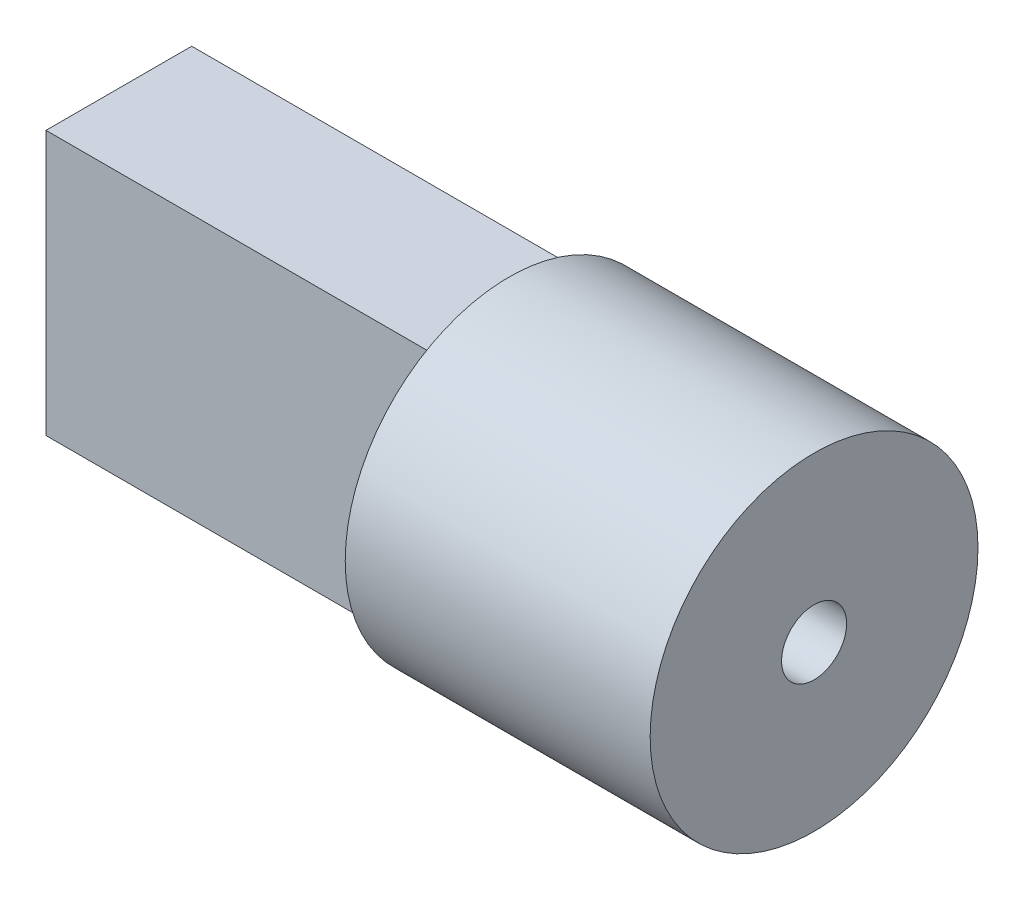
ISO-10303-21;
HEADER;
FILE_DESCRIPTION(('STEP AP214'),'2;1');
FILE_NAME('part.step','',(''),(''),'','','');
FILE_SCHEMA(('AUTOMOTIVE_DESIGN { 1 0 10303 214 1 1 1 1 }'));
ENDSEC;
DATA;
#1=APPLICATION_CONTEXT('core data for automotive mechanical design processes');
#2=APPLICATION_PROTOCOL_DEFINITION('international standard','automotive_design',2000,#1);
#3=PRODUCT_CONTEXT('',#1,'mechanical');
#4=PRODUCT('Part','Part','',(#3));
#5=PRODUCT_RELATED_PRODUCT_CATEGORY('part','',(#4));
#6=PRODUCT_DEFINITION_FORMATION('','',#4);
#7=PRODUCT_DEFINITION_CONTEXT('part definition',#1,'design');
#8=PRODUCT_DEFINITION('design','',#6,#7);
#9=PRODUCT_DEFINITION_SHAPE('','',#8);
#10=(LENGTH_UNIT() NAMED_UNIT(*) SI_UNIT(.MILLI.,.METRE.));
#11=(NAMED_UNIT(*) PLANE_ANGLE_UNIT() SI_UNIT($,.RADIAN.));
#12=(NAMED_UNIT(*) SI_UNIT($,.STERADIAN.) SOLID_ANGLE_UNIT());
#13=UNCERTAINTY_MEASURE_WITH_UNIT(LENGTH_MEASURE(1.E-05),#10,'distance_accuracy_value','');
#14=(GEOMETRIC_REPRESENTATION_CONTEXT(3) GLOBAL_UNCERTAINTY_ASSIGNED_CONTEXT((#13)) GLOBAL_UNIT_ASSIGNED_CONTEXT((#10,
#11,#12)) REPRESENTATION_CONTEXT('',''));
#15=CARTESIAN_POINT('',(0.,0.,0.));
#16=DIRECTION('',(0.,0.,1.));
#17=DIRECTION('',(1.,0.,0.));
#18=AXIS2_PLACEMENT_3D('',#15,#16,#17);
#19=CARTESIAN_POINT('',(-7.4422,0.,0.));
#20=DIRECTION('',(1.,0.,0.));
#21=DIRECTION('',(0.,0.,-1.));
#22=AXIS2_PLACEMENT_3D('',#19,#20,#21);
#23=PLANE('',#22);
#24=CARTESIAN_POINT('',(-7.4422,0.,0.));
#25=DIRECTION('',(1.,0.,0.));
#26=DIRECTION('',(0.,0.,-1.));
#27=AXIS2_PLACEMENT_3D('',#24,#25,#26);
#28=CIRCLE('',#27,4.0005);
#29=CARTESIAN_POINT('',(-7.4422,0.,-4.0005));
#30=VERTEX_POINT('',#29);
#31=EDGE_CURVE('E11',#30,#30,#28,.T.);
#32=ORIENTED_EDGE('',*,*,#31,.F.);
#33=EDGE_LOOP('',(#32));
#34=FACE_BOUND('',#33,.T.);
#35=DIRECTION('',(0.,-1.,0.));
#36=VECTOR('',#35,1.);
#37=CARTESIAN_POINT('',(-7.4422,3.2258,-1.778));
#38=LINE('',#37,#36);
#39=CARTESIAN_POINT('',(-7.4422,3.2258,-1.778));
#40=VERTEX_POINT('',#39);
#41=CARTESIAN_POINT('',(-7.4422,-3.2258,-1.778));
#42=VERTEX_POINT('',#41);
#43=EDGE_CURVE('E397',#40,#42,#38,.T.);
#44=ORIENTED_EDGE('',*,*,#43,.F.);
#45=DIRECTION('',(0.,0.,-1.));
#46=VECTOR('',#45,1.);
#47=CARTESIAN_POINT('',(-7.4422,3.2258,-1.778));
#48=LINE('',#47,#46);
#49=CARTESIAN_POINT('',(-7.4422,3.2258,1.778));
#50=VERTEX_POINT('',#49);
#51=EDGE_CURVE('E399',#50,#40,#48,.T.);
#52=ORIENTED_EDGE('',*,*,#51,.F.);
#53=DIRECTION('',(0.,1.,0.));
#54=VECTOR('',#53,1.);
#55=CARTESIAN_POINT('',(-7.4422,3.2258,1.778));
#56=LINE('',#55,#54);
#57=CARTESIAN_POINT('',(-7.4422,-3.2258,1.778));
#58=VERTEX_POINT('',#57);
#59=EDGE_CURVE('E380',#58,#50,#56,.T.);
#60=ORIENTED_EDGE('',*,*,#59,.F.);
#61=DIRECTION('',(0.,0.,1.));
#62=VECTOR('',#61,1.);
#63=CARTESIAN_POINT('',(-7.4422,-3.2258,-1.778));
#64=LINE('',#63,#62);
#65=EDGE_CURVE('E375',#42,#58,#64,.T.);
#66=ORIENTED_EDGE('',*,*,#65,.F.);
#67=EDGE_LOOP('',(#44,#52,#60,#66));
#68=FACE_BOUND('',#67,.T.);
#69=ADVANCED_FACE('F360',(#34,#68),#23,.F.);
#70=CARTESIAN_POINT('',(-7.4422,0.,0.));
#71=DIRECTION('',(1.,0.,0.));
#72=DIRECTION('',(0.,0.,-1.));
#73=AXIS2_PLACEMENT_3D('',#70,#71,#72);
#74=CYLINDRICAL_SURFACE('',#73,4.0005);
#75=ORIENTED_EDGE('',*,*,#31,.T.);
#76=EDGE_LOOP('',(#75));
#77=FACE_BOUND('',#76,.T.);
#78=CARTESIAN_POINT('',(0.,0.,0.));
#79=DIRECTION('',(1.,0.,0.));
#80=DIRECTION('',(0.,0.,-1.));
#81=AXIS2_PLACEMENT_3D('',#78,#79,#80);
#82=CIRCLE('',#81,4.0005);
#83=CARTESIAN_POINT('',(0.,0.,-4.0005));
#84=VERTEX_POINT('',#83);
#85=EDGE_CURVE('E368',#84,#84,#82,.T.);
#86=ORIENTED_EDGE('',*,*,#85,.F.);
#87=EDGE_LOOP('',(#86));
#88=FACE_BOUND('',#87,.T.);
#89=ADVANCED_FACE('F362',(#77,#88),#74,.T.);
#90=CARTESIAN_POINT('',(0.,0.,0.));
#91=DIRECTION('',(1.,0.,0.));
#92=DIRECTION('',(0.,0.,-1.));
#93=AXIS2_PLACEMENT_3D('',#90,#91,#92);
#94=PLANE('',#93);
#95=CARTESIAN_POINT('',(0.,0.,0.));
#96=DIRECTION('',(1.,0.,0.));
#97=DIRECTION('',(0.,0.,-1.));
#98=AXIS2_PLACEMENT_3D('',#95,#96,#97);
#99=CIRCLE('',#98,0.79375);
#100=CARTESIAN_POINT('',(0.,0.,-0.79375));
#101=VERTEX_POINT('',#100);
#102=EDGE_CURVE('E429',#101,#101,#99,.T.);
#103=ORIENTED_EDGE('',*,*,#102,.F.);
#104=EDGE_LOOP('',(#103));
#105=FACE_BOUND('',#104,.T.);
#106=ORIENTED_EDGE('',*,*,#85,.T.);
#107=EDGE_LOOP('',(#106));
#108=FACE_BOUND('',#107,.T.);
#109=ADVANCED_FACE('F437',(#105,#108),#94,.T.);
#110=CARTESIAN_POINT('',(-7.4422,0.,0.));
#111=DIRECTION('',(1.,0.,0.));
#112=DIRECTION('',(0.,0.,-1.));
#113=AXIS2_PLACEMENT_3D('',#110,#111,#112);
#114=CYLINDRICAL_SURFACE('',#113,0.79375);
#115=CARTESIAN_POINT('',(-7.4422,0.,0.));
#116=DIRECTION('',(1.,0.,0.));
#117=DIRECTION('',(0.,0.,-1.));
#118=AXIS2_PLACEMENT_3D('',#115,#116,#117);
#119=CIRCLE('',#118,0.79375);
#120=CARTESIAN_POINT('',(-7.4422,0.,-0.79375));
#121=VERTEX_POINT('',#120);
#122=EDGE_CURVE('E432',#121,#121,#119,.T.);
#123=ORIENTED_EDGE('',*,*,#122,.F.);
#124=EDGE_LOOP('',(#123));
#125=FACE_BOUND('',#124,.T.);
#126=ORIENTED_EDGE('',*,*,#102,.T.);
#127=EDGE_LOOP('',(#126));
#128=FACE_BOUND('',#127,.T.);
#129=ADVANCED_FACE('F444',(#125,#128),#114,.F.);
#130=CARTESIAN_POINT('',(-7.4422,-3.2258,-1.778));
#131=DIRECTION('',(-1.,0.,0.));
#132=DIRECTION('',(0.,0.,1.));
#133=AXIS2_PLACEMENT_3D('',#130,#131,#132);
#134=PLANE('',#133);
#135=ORIENTED_EDGE('',*,*,#122,.T.);
#136=EDGE_LOOP('',(#135));
#137=FACE_BOUND('',#136,.T.);
#138=ADVANCED_FACE('F456',(#137),#134,.F.);
#139=CARTESIAN_POINT('',(-16.9672,3.2258,-1.778));
#140=DIRECTION('',(0.,0.,1.));
#141=DIRECTION('',(0.,-1.,0.));
#142=AXIS2_PLACEMENT_3D('',#139,#140,#141);
#143=PLANE('',#142);
#144=ORIENTED_EDGE('',*,*,#43,.T.);
#145=DIRECTION('',(1.,0.,0.));
#146=VECTOR('',#145,1.);
#147=CARTESIAN_POINT('',(-16.9672,-3.2258,-1.778));
#148=LINE('',#147,#146);
#149=CARTESIAN_POINT('',(-16.9672,-3.2258,-1.778));
#150=VERTEX_POINT('',#149);
#151=EDGE_CURVE('E427',#150,#42,#148,.T.);
#152=ORIENTED_EDGE('',*,*,#151,.F.);
#153=DIRECTION('',(0.,-1.,0.));
#154=VECTOR('',#153,1.);
#155=CARTESIAN_POINT('',(-16.9672,3.2258,-1.778));
#156=LINE('',#155,#154);
#157=CARTESIAN_POINT('',(-16.9672,3.2258,-1.778));
#158=VERTEX_POINT('',#157);
#159=EDGE_CURVE('E413',#158,#150,#156,.T.);
#160=ORIENTED_EDGE('',*,*,#159,.F.);
#161=DIRECTION('',(1.,0.,0.));
#162=VECTOR('',#161,1.);
#163=CARTESIAN_POINT('',(-16.9672,3.2258,-1.778));
#164=LINE('',#163,#162);
#165=EDGE_CURVE('E409',#158,#40,#164,.T.);
#166=ORIENTED_EDGE('',*,*,#165,.T.);
#167=EDGE_LOOP('',(#144,#152,#160,#166));
#168=FACE_BOUND('',#167,.T.);
#169=ADVANCED_FACE('F415',(#168),#143,.F.);
#170=CARTESIAN_POINT('',(-16.9672,-3.2258,-1.778));
#171=DIRECTION('',(0.,1.,0.));
#172=DIRECTION('',(0.,0.,1.));
#173=AXIS2_PLACEMENT_3D('',#170,#171,#172);
#174=PLANE('',#173);
#175=ORIENTED_EDGE('',*,*,#65,.T.);
#176=DIRECTION('',(1.,0.,0.));
#177=VECTOR('',#176,1.);
#178=CARTESIAN_POINT('',(-16.9672,-3.2258,1.778));
#179=LINE('',#178,#177);
#180=CARTESIAN_POINT('',(-16.9672,-3.2258,1.778));
#181=VERTEX_POINT('',#180);
#182=EDGE_CURVE('E419',#181,#58,#179,.T.);
#183=ORIENTED_EDGE('',*,*,#182,.F.);
#184=DIRECTION('',(0.,0.,1.));
#185=VECTOR('',#184,1.);
#186=CARTESIAN_POINT('',(-16.9672,-3.2258,-1.778));
#187=LINE('',#186,#185);
#188=EDGE_CURVE('E514',#150,#181,#187,.T.);
#189=ORIENTED_EDGE('',*,*,#188,.F.);
#190=ORIENTED_EDGE('',*,*,#151,.T.);
#191=EDGE_LOOP('',(#175,#183,#189,#190));
#192=FACE_BOUND('',#191,.T.);
#193=ADVANCED_FACE('F460',(#192),#174,.F.);
#194=CARTESIAN_POINT('',(-16.9672,3.2258,1.778));
#195=DIRECTION('',(0.,0.,-1.));
#196=DIRECTION('',(0.,1.,0.));
#197=AXIS2_PLACEMENT_3D('',#194,#195,#196);
#198=PLANE('',#197);
#199=ORIENTED_EDGE('',*,*,#59,.T.);
#200=DIRECTION('',(1.,0.,0.));
#201=VECTOR('',#200,1.);
#202=CARTESIAN_POINT('',(-16.9672,3.2258,1.778));
#203=LINE('',#202,#201);
#204=CARTESIAN_POINT('',(-16.9672,3.2258,1.778));
#205=VERTEX_POINT('',#204);
#206=EDGE_CURVE('E412',#205,#50,#203,.T.);
#207=ORIENTED_EDGE('',*,*,#206,.F.);
#208=DIRECTION('',(0.,1.,0.));
#209=VECTOR('',#208,1.);
#210=CARTESIAN_POINT('',(-16.9672,3.2258,1.778));
#211=LINE('',#210,#209);
#212=EDGE_CURVE('E421',#181,#205,#211,.T.);
#213=ORIENTED_EDGE('',*,*,#212,.F.);
#214=ORIENTED_EDGE('',*,*,#182,.T.);
#215=EDGE_LOOP('',(#199,#207,#213,#214));
#216=FACE_BOUND('',#215,.T.);
#217=ADVANCED_FACE('F463',(#216),#198,.F.);
#218=CARTESIAN_POINT('',(-16.9672,3.2258,-1.778));
#219=DIRECTION('',(0.,-1.,0.));
#220=DIRECTION('',(0.,0.,-1.));
#221=AXIS2_PLACEMENT_3D('',#218,#219,#220);
#222=PLANE('',#221);
#223=ORIENTED_EDGE('',*,*,#51,.T.);
#224=ORIENTED_EDGE('',*,*,#165,.F.);
#225=DIRECTION('',(0.,0.,-1.));
#226=VECTOR('',#225,1.);
#227=CARTESIAN_POINT('',(-16.9672,3.2258,-1.778));
#228=LINE('',#227,#226);
#229=EDGE_CURVE('E417',#205,#158,#228,.T.);
#230=ORIENTED_EDGE('',*,*,#229,.F.);
#231=ORIENTED_EDGE('',*,*,#206,.T.);
#232=EDGE_LOOP('',(#223,#224,#230,#231));
#233=FACE_BOUND('',#232,.T.);
#234=ADVANCED_FACE('F407',(#233),#222,.F.);
#235=CARTESIAN_POINT('',(-16.9672,-3.2258,-1.778));
#236=DIRECTION('',(-1.,0.,0.));
#237=DIRECTION('',(0.,0.,1.));
#238=AXIS2_PLACEMENT_3D('',#235,#236,#237);
#239=PLANE('',#238);
#240=ORIENTED_EDGE('',*,*,#159,.T.);
#241=ORIENTED_EDGE('',*,*,#188,.T.);
#242=ORIENTED_EDGE('',*,*,#212,.T.);
#243=ORIENTED_EDGE('',*,*,#229,.T.);
#244=EDGE_LOOP('',(#240,#241,#242,#243));
#245=FACE_BOUND('',#244,.T.);
#246=ADVANCED_FACE('F470',(#245),#239,.T.);
#247=CLOSED_SHELL('',(#69,#89,#109,#129,#138,#169,#193,#217,#234,#246));
#248=MANIFOLD_SOLID_BREP('B2',#247);
#249=ADVANCED_BREP_SHAPE_REPRESENTATION('',(#18,#248),#14);
#250=SHAPE_DEFINITION_REPRESENTATION(#9,#249);
ENDSEC;
END-ISO-10303-21;
